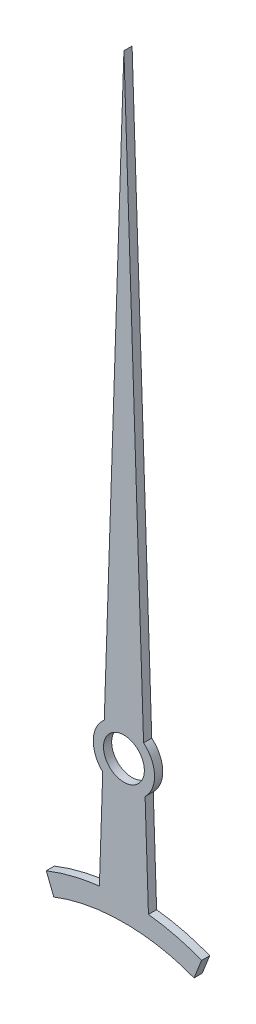
ISO-10303-21;
HEADER;
FILE_DESCRIPTION(('STEP AP214'),'2;1');
FILE_NAME('part.step','',(''),(''),'','','');
FILE_SCHEMA(('AUTOMOTIVE_DESIGN { 1 0 10303 214 1 1 1 1 }'));
ENDSEC;
DATA;
#1=APPLICATION_CONTEXT('core data for automotive mechanical design processes');
#2=APPLICATION_PROTOCOL_DEFINITION('international standard','automotive_design',2000,#1);
#3=PRODUCT_CONTEXT('',#1,'mechanical');
#4=PRODUCT('Part','Part','',(#3));
#5=PRODUCT_RELATED_PRODUCT_CATEGORY('part','',(#4));
#6=PRODUCT_DEFINITION_FORMATION('','',#4);
#7=PRODUCT_DEFINITION_CONTEXT('part definition',#1,'design');
#8=PRODUCT_DEFINITION('design','',#6,#7);
#9=PRODUCT_DEFINITION_SHAPE('','',#8);
#10=(LENGTH_UNIT() NAMED_UNIT(*) SI_UNIT(.MILLI.,.METRE.));
#11=(NAMED_UNIT(*) PLANE_ANGLE_UNIT() SI_UNIT($,.RADIAN.));
#12=(NAMED_UNIT(*) SI_UNIT($,.STERADIAN.) SOLID_ANGLE_UNIT());
#13=UNCERTAINTY_MEASURE_WITH_UNIT(LENGTH_MEASURE(1.E-05),#10,'distance_accuracy_value','');
#14=(GEOMETRIC_REPRESENTATION_CONTEXT(3) GLOBAL_UNCERTAINTY_ASSIGNED_CONTEXT((#13)) GLOBAL_UNIT_ASSIGNED_CONTEXT((#10,
#11,#12)) REPRESENTATION_CONTEXT('',''));
#15=CARTESIAN_POINT('',(0.,0.,0.));
#16=DIRECTION('',(0.,0.,1.));
#17=DIRECTION('',(1.,0.,0.));
#18=AXIS2_PLACEMENT_3D('',#15,#16,#17);
#19=CARTESIAN_POINT('',(-0.499445061043285,0.0166481687014428,0.2));
#20=DIRECTION('',(-0.999444906979154,0.0333148302326385,0.));
#21=DIRECTION('',(-0.0333148302326385,-0.999444906979154,0.));
#22=AXIS2_PLACEMENT_3D('',#19,#20,#21);
#23=PLANE('',#22);
#24=DIRECTION('',(0.0333148302326385,0.999444906979154,0.));
#25=VECTOR('',#24,1.);
#26=CARTESIAN_POINT('',(-0.499445061043285,0.0166481687014428,0.));
#27=LINE('',#26,#25);
#28=CARTESIAN_POINT('',(-0.480813238663485,0.575602840095434,0.));
#29=VERTEX_POINT('',#28);
#30=CARTESIAN_POINT('',(0.,15.,0.));
#31=VERTEX_POINT('',#30);
#32=EDGE_CURVE('E154',#29,#31,#27,.T.);
#33=ORIENTED_EDGE('',*,*,#32,.F.);
#34=DIRECTION('',(0.,0.,-1.));
#35=VECTOR('',#34,1.);
#36=CARTESIAN_POINT('',(-0.480813238663485,0.575602840095434,0.2));
#37=LINE('',#36,#35);
#38=CARTESIAN_POINT('',(-0.480813238663485,0.575602840095434,0.2));
#39=VERTEX_POINT('',#38);
#40=EDGE_CURVE('E11',#39,#29,#37,.T.);
#41=ORIENTED_EDGE('',*,*,#40,.F.);
#42=DIRECTION('',(0.0333148302326385,0.999444906979154,0.));
#43=VECTOR('',#42,1.);
#44=CARTESIAN_POINT('',(-0.499445061043285,0.0166481687014428,0.2));
#45=LINE('',#44,#43);
#46=CARTESIAN_POINT('',(0.,15.,0.2));
#47=VERTEX_POINT('',#46);
#48=EDGE_CURVE('E190',#39,#47,#45,.T.);
#49=ORIENTED_EDGE('',*,*,#48,.T.);
#50=DIRECTION('',(0.,0.,-1.));
#51=VECTOR('',#50,1.);
#52=CARTESIAN_POINT('',(0.,15.,0.2));
#53=LINE('',#52,#51);
#54=EDGE_CURVE('E50',#47,#31,#53,.T.);
#55=ORIENTED_EDGE('',*,*,#54,.T.);
#56=EDGE_LOOP('',(#33,#41,#49,#55));
#57=FACE_BOUND('',#56,.T.);
#58=ADVANCED_FACE('F34',(#57),#23,.T.);
#59=CARTESIAN_POINT('',(0.,0.,0.2));
#60=DIRECTION('',(0.,0.,-1.));
#61=DIRECTION('',(-1.,0.,0.));
#62=AXIS2_PLACEMENT_3D('',#59,#60,#61);
#63=CYLINDRICAL_SURFACE('',#62,0.75);
#64=CARTESIAN_POINT('',(0.,0.,0.));
#65=DIRECTION('',(0.,0.,1.));
#66=DIRECTION('',(1.,0.,0.));
#67=AXIS2_PLACEMENT_3D('',#64,#65,#66);
#68=CIRCLE('',#67,0.75);
#69=CARTESIAN_POINT('',(-0.518076883423085,-0.542306502692549,0.));
#70=VERTEX_POINT('',#69);
#71=EDGE_CURVE('E156',#29,#70,#68,.T.);
#72=ORIENTED_EDGE('',*,*,#71,.T.);
#73=DIRECTION('',(0.,0.,-1.));
#74=VECTOR('',#73,1.);
#75=CARTESIAN_POINT('',(-0.518076883423085,-0.542306502692549,0.2));
#76=LINE('',#75,#74);
#77=CARTESIAN_POINT('',(-0.518076883423085,-0.542306502692549,0.2));
#78=VERTEX_POINT('',#77);
#79=EDGE_CURVE('E42',#78,#70,#76,.T.);
#80=ORIENTED_EDGE('',*,*,#79,.F.);
#81=CARTESIAN_POINT('',(0.,0.,0.2));
#82=DIRECTION('',(0.,0.,1.));
#83=DIRECTION('',(1.,0.,0.));
#84=AXIS2_PLACEMENT_3D('',#81,#82,#83);
#85=CIRCLE('',#84,0.75);
#86=EDGE_CURVE('E136',#39,#78,#85,.T.);
#87=ORIENTED_EDGE('',*,*,#86,.F.);
#88=ORIENTED_EDGE('',*,*,#40,.T.);
#89=EDGE_LOOP('',(#72,#80,#87,#88));
#90=FACE_BOUND('',#89,.T.);
#91=ADVANCED_FACE('F275',(#90),#63,.T.);
#92=CARTESIAN_POINT('',(-0.499445061043285,0.0166481687014427,0.2));
#93=DIRECTION('',(0.999444906979154,-0.0333148302326382,0.));
#94=DIRECTION('',(0.0333148302326382,0.999444906979154,0.));
#95=AXIS2_PLACEMENT_3D('',#92,#93,#94);
#96=PLANE('',#95);
#97=DIRECTION('',(-0.0333148302326382,-0.999444906979154,0.));
#98=VECTOR('',#97,1.);
#99=CARTESIAN_POINT('',(-0.499445061043285,0.0166481687014427,0.));
#100=LINE('',#99,#98);
#101=CARTESIAN_POINT('',(-0.599999999999999,-3.,0.));
#102=VERTEX_POINT('',#101);
#103=EDGE_CURVE('E158',#70,#102,#100,.T.);
#104=ORIENTED_EDGE('',*,*,#103,.T.);
#105=DIRECTION('',(0.,0.,-1.));
#106=VECTOR('',#105,1.);
#107=CARTESIAN_POINT('',(-0.599999999999999,-3.,0.2));
#108=LINE('',#107,#106);
#109=CARTESIAN_POINT('',(-0.599999999999999,-3.,0.2));
#110=VERTEX_POINT('',#109);
#111=EDGE_CURVE('E204',#110,#102,#108,.T.);
#112=ORIENTED_EDGE('',*,*,#111,.F.);
#113=DIRECTION('',(-0.0333148302326382,-0.999444906979154,0.));
#114=VECTOR('',#113,1.);
#115=CARTESIAN_POINT('',(-0.499445061043285,0.0166481687014427,0.2));
#116=LINE('',#115,#114);
#117=EDGE_CURVE('E212',#78,#110,#116,.T.);
#118=ORIENTED_EDGE('',*,*,#117,.F.);
#119=ORIENTED_EDGE('',*,*,#79,.T.);
#120=EDGE_LOOP('',(#104,#112,#118,#119));
#121=FACE_BOUND('',#120,.T.);
#122=ADVANCED_FACE('F210',(#121),#96,.F.);
#123=CARTESIAN_POINT('',(-1.9,-3.32498143713202,0.2));
#124=CARTESIAN_POINT('',(-1.48291239155075,-3.15950522754239,0.2));
#125=CARTESIAN_POINT('',(-0.652310010937064,-2.9541690470115,0.2));
#126=CARTESIAN_POINT('',(0.652310010937064,-2.9541690470115,0.2));
#127=CARTESIAN_POINT('',(1.48291239155075,-3.15950522754239,0.2));
#128=CARTESIAN_POINT('',(1.9,-3.32498143713202,0.2));
#129=B_SPLINE_CURVE_WITH_KNOTS('',3,(#123,#124,#125,#126,#127,#128),.UNSPECIFIED.,.F.,.F.,(4,1,
1,4),(0.,0.3453612094493,0.6546387905507,1.),.UNSPECIFIED.);
#130=DIRECTION('',(0.,0.,-1.));
#131=VECTOR('',#130,1.);
#132=SURFACE_OF_LINEAR_EXTRUSION('',#129,#131);
#133=CARTESIAN_POINT('',(-1.9,-3.32498143713202,0.));
#134=CARTESIAN_POINT('',(-1.48291239155075,-3.15950522754239,0.));
#135=CARTESIAN_POINT('',(-0.652310010937064,-2.9541690470115,0.));
#136=CARTESIAN_POINT('',(0.652310010937064,-2.9541690470115,0.));
#137=CARTESIAN_POINT('',(1.48291239155075,-3.15950522754239,0.));
#138=CARTESIAN_POINT('',(1.9,-3.32498143713202,0.));
#139=B_SPLINE_CURVE_WITH_KNOTS('',3,(#133,#134,#135,#136,#137,#138),.UNSPECIFIED.,.F.,.F.,(4,1,
1,4),(0.,0.3453612094493,0.6546387905507,1.),.UNSPECIFIED.);
#140=CARTESIAN_POINT('',(-1.9,-3.32498143713202,0.));
#141=VERTEX_POINT('',#140);
#142=EDGE_CURVE('E162',#141,#102,#139,.T.);
#143=ORIENTED_EDGE('',*,*,#142,.F.);
#144=DIRECTION('',(0.,0.,-1.));
#145=VECTOR('',#144,1.);
#146=CARTESIAN_POINT('',(-1.9,-3.32498143713202,0.2));
#147=LINE('',#146,#145);
#148=CARTESIAN_POINT('',(-1.9,-3.32498143713202,0.2));
#149=VERTEX_POINT('',#148);
#150=EDGE_CURVE('E202',#149,#141,#147,.T.);
#151=ORIENTED_EDGE('',*,*,#150,.F.);
#152=EDGE_CURVE('E146',#149,#110,#129,.T.);
#153=ORIENTED_EDGE('',*,*,#152,.T.);
#154=ORIENTED_EDGE('',*,*,#111,.T.);
#155=EDGE_LOOP('',(#143,#151,#153,#154));
#156=FACE_BOUND('',#155,.T.);
#157=ADVANCED_FACE('F222',(#156),#132,.T.);
#158=CARTESIAN_POINT('',(-2.78136181440616,-1.10348329996309,0.2));
#159=DIRECTION('',(0.929517256428634,0.36877861923027,0.));
#160=DIRECTION('',(-0.36877861923027,0.929517256428634,0.));
#161=AXIS2_PLACEMENT_3D('',#158,#159,#160);
#162=PLANE('',#161);
#163=DIRECTION('',(0.36877861923027,-0.929517256428634,0.));
#164=VECTOR('',#163,1.);
#165=CARTESIAN_POINT('',(-2.78136181440616,-1.10348329996309,0.));
#166=LINE('',#165,#164);
#167=CARTESIAN_POINT('',(-1.71561069038486,-3.78974006534634,0.));
#168=VERTEX_POINT('',#167);
#169=EDGE_CURVE('E167',#141,#168,#166,.T.);
#170=ORIENTED_EDGE('',*,*,#169,.T.);
#171=DIRECTION('',(0.,0.,-1.));
#172=VECTOR('',#171,1.);
#173=CARTESIAN_POINT('',(-1.71561069038486,-3.78974006534634,0.2));
#174=LINE('',#173,#172);
#175=CARTESIAN_POINT('',(-1.71561069038486,-3.78974006534634,0.2));
#176=VERTEX_POINT('',#175);
#177=EDGE_CURVE('E199',#176,#168,#174,.T.);
#178=ORIENTED_EDGE('',*,*,#177,.F.);
#179=DIRECTION('',(0.36877861923027,-0.929517256428634,0.));
#180=VECTOR('',#179,1.);
#181=CARTESIAN_POINT('',(-2.78136181440616,-1.10348329996309,0.2));
#182=LINE('',#181,#180);
#183=EDGE_CURVE('E226',#149,#176,#182,.T.);
#184=ORIENTED_EDGE('',*,*,#183,.F.);
#185=ORIENTED_EDGE('',*,*,#150,.T.);
#186=EDGE_LOOP('',(#170,#178,#184,#185));
#187=FACE_BOUND('',#186,.T.);
#188=ADVANCED_FACE('F250',(#187),#162,.F.);
#189=CARTESIAN_POINT('',(-1.71561069038487,-3.78974006534634,0.2));
#190=CARTESIAN_POINT('',(-0.652484195700749,-3.36795303765513,0.2));
#191=CARTESIAN_POINT('',(0.652484195700749,-3.36795303765512,0.2));
#192=CARTESIAN_POINT('',(1.71561069038486,-3.78974006534634,0.2));
#193=B_SPLINE_CURVE_WITH_KNOTS('',3,(#189,#190,#191,#192),.UNSPECIFIED.,.F.,.F.,(4,4),(0.,1.),.UNSPECIFIED.);
#194=DIRECTION('',(0.,0.,-1.));
#195=VECTOR('',#194,1.);
#196=SURFACE_OF_LINEAR_EXTRUSION('',#193,#195);
#197=CARTESIAN_POINT('',(-1.71561069038487,-3.78974006534634,0.));
#198=CARTESIAN_POINT('',(-0.652484195700749,-3.36795303765513,0.));
#199=CARTESIAN_POINT('',(0.652484195700749,-3.36795303765512,0.));
#200=CARTESIAN_POINT('',(1.71561069038486,-3.78974006534634,0.));
#201=B_SPLINE_CURVE_WITH_KNOTS('',3,(#197,#198,#199,#200),.UNSPECIFIED.,.F.,.F.,(4,4),(0.,1.),.UNSPECIFIED.);
#202=CARTESIAN_POINT('',(1.71561069038486,-3.78974006534634,0.));
#203=VERTEX_POINT('',#202);
#204=EDGE_CURVE('E173',#168,#203,#201,.T.);
#205=ORIENTED_EDGE('',*,*,#204,.T.);
#206=DIRECTION('',(0.,0.,-1.));
#207=VECTOR('',#206,1.);
#208=CARTESIAN_POINT('',(1.71561069038486,-3.78974006534634,0.2));
#209=LINE('',#208,#207);
#210=CARTESIAN_POINT('',(1.71561069038486,-3.78974006534634,0.2));
#211=VERTEX_POINT('',#210);
#212=EDGE_CURVE('E196',#211,#203,#209,.T.);
#213=ORIENTED_EDGE('',*,*,#212,.F.);
#214=EDGE_CURVE('E227',#176,#211,#193,.T.);
#215=ORIENTED_EDGE('',*,*,#214,.F.);
#216=ORIENTED_EDGE('',*,*,#177,.T.);
#217=EDGE_LOOP('',(#205,#213,#215,#216));
#218=FACE_BOUND('',#217,.T.);
#219=ADVANCED_FACE('F246',(#218),#196,.F.);
#220=CARTESIAN_POINT('',(2.78136181440617,-1.1034832999631,0.2));
#221=DIRECTION('',(-0.929517256428633,0.368778619230273,0.));
#222=DIRECTION('',(-0.368778619230273,-0.929517256428633,0.));
#223=AXIS2_PLACEMENT_3D('',#220,#221,#222);
#224=PLANE('',#223);
#225=DIRECTION('',(0.368778619230273,0.929517256428633,0.));
#226=VECTOR('',#225,1.);
#227=CARTESIAN_POINT('',(2.78136181440617,-1.1034832999631,0.));
#228=LINE('',#227,#226);
#229=CARTESIAN_POINT('',(1.9,-3.32498143713202,0.));
#230=VERTEX_POINT('',#229);
#231=EDGE_CURVE('E177',#203,#230,#228,.T.);
#232=ORIENTED_EDGE('',*,*,#231,.T.);
#233=DIRECTION('',(0.,0.,-1.));
#234=VECTOR('',#233,1.);
#235=CARTESIAN_POINT('',(1.9,-3.32498143713202,0.2));
#236=LINE('',#235,#234);
#237=CARTESIAN_POINT('',(1.9,-3.32498143713202,0.2));
#238=VERTEX_POINT('',#237);
#239=EDGE_CURVE('E194',#238,#230,#236,.T.);
#240=ORIENTED_EDGE('',*,*,#239,.F.);
#241=DIRECTION('',(0.368778619230273,0.929517256428633,0.));
#242=VECTOR('',#241,1.);
#243=CARTESIAN_POINT('',(2.78136181440617,-1.1034832999631,0.2));
#244=LINE('',#243,#242);
#245=EDGE_CURVE('E144',#211,#238,#244,.T.);
#246=ORIENTED_EDGE('',*,*,#245,.F.);
#247=ORIENTED_EDGE('',*,*,#212,.T.);
#248=EDGE_LOOP('',(#232,#240,#246,#247));
#249=FACE_BOUND('',#248,.T.);
#250=ADVANCED_FACE('F241',(#249),#224,.F.);
#251=CARTESIAN_POINT('',(0.6,-3.,0.));
#252=VERTEX_POINT('',#251);
#253=EDGE_CURVE('E168',#252,#230,#139,.T.);
#254=ORIENTED_EDGE('',*,*,#253,.F.);
#255=DIRECTION('',(0.,0.,-1.));
#256=VECTOR('',#255,1.);
#257=CARTESIAN_POINT('',(0.6,-3.,0.2));
#258=LINE('',#257,#256);
#259=CARTESIAN_POINT('',(0.6,-3.,0.2));
#260=VERTEX_POINT('',#259);
#261=EDGE_CURVE('E128',#260,#252,#258,.T.);
#262=ORIENTED_EDGE('',*,*,#261,.F.);
#263=EDGE_CURVE('E142',#260,#238,#129,.T.);
#264=ORIENTED_EDGE('',*,*,#263,.T.);
#265=ORIENTED_EDGE('',*,*,#239,.T.);
#266=EDGE_LOOP('',(#254,#262,#264,#265));
#267=FACE_BOUND('',#266,.T.);
#268=ADVANCED_FACE('F237',(#267),#132,.T.);
#269=CARTESIAN_POINT('',(0.499445061043285,0.0166481687014428,0.2));
#270=DIRECTION('',(0.999444906979154,0.0333148302326384,0.));
#271=DIRECTION('',(-0.0333148302326384,0.999444906979154,0.));
#272=AXIS2_PLACEMENT_3D('',#269,#270,#271);
#273=PLANE('',#272);
#274=DIRECTION('',(0.0333148302326384,-0.999444906979154,0.));
#275=VECTOR('',#274,1.);
#276=CARTESIAN_POINT('',(0.499445061043285,0.0166481687014428,0.));
#277=LINE('',#276,#275);
#278=CARTESIAN_POINT('',(0.518076883423085,-0.542306502692548,0.));
#279=VERTEX_POINT('',#278);
#280=EDGE_CURVE('E125',#279,#252,#277,.T.);
#281=ORIENTED_EDGE('',*,*,#280,.F.);
#282=DIRECTION('',(0.,0.,-1.));
#283=VECTOR('',#282,1.);
#284=CARTESIAN_POINT('',(0.518076883423085,-0.542306502692548,0.2));
#285=LINE('',#284,#283);
#286=CARTESIAN_POINT('',(0.518076883423085,-0.542306502692548,0.2));
#287=VERTEX_POINT('',#286);
#288=EDGE_CURVE('E119',#287,#279,#285,.T.);
#289=ORIENTED_EDGE('',*,*,#288,.F.);
#290=DIRECTION('',(0.0333148302326384,-0.999444906979154,0.));
#291=VECTOR('',#290,1.);
#292=CARTESIAN_POINT('',(0.499445061043285,0.0166481687014428,0.2));
#293=LINE('',#292,#291);
#294=EDGE_CURVE('E123',#287,#260,#293,.T.);
#295=ORIENTED_EDGE('',*,*,#294,.T.);
#296=ORIENTED_EDGE('',*,*,#261,.T.);
#297=EDGE_LOOP('',(#281,#289,#295,#296));
#298=FACE_BOUND('',#297,.T.);
#299=ADVANCED_FACE('F121',(#298),#273,.T.);
#300=CARTESIAN_POINT('',(0.480813238663486,0.575602840095434,0.));
#301=VERTEX_POINT('',#300);
#302=EDGE_CURVE('E159',#279,#301,#68,.T.);
#303=ORIENTED_EDGE('',*,*,#302,.T.);
#304=DIRECTION('',(0.,0.,-1.));
#305=VECTOR('',#304,1.);
#306=CARTESIAN_POINT('',(0.480813238663486,0.575602840095434,0.2));
#307=LINE('',#306,#305);
#308=CARTESIAN_POINT('',(0.480813238663486,0.575602840095434,0.2));
#309=VERTEX_POINT('',#308);
#310=EDGE_CURVE('E85',#309,#301,#307,.T.);
#311=ORIENTED_EDGE('',*,*,#310,.F.);
#312=EDGE_CURVE('E130',#287,#309,#85,.T.);
#313=ORIENTED_EDGE('',*,*,#312,.F.);
#314=ORIENTED_EDGE('',*,*,#288,.T.);
#315=EDGE_LOOP('',(#303,#311,#313,#314));
#316=FACE_BOUND('',#315,.T.);
#317=ADVANCED_FACE('F131',(#316),#63,.T.);
#318=CARTESIAN_POINT('',(0.499445061043285,0.0166481687014428,0.2));
#319=DIRECTION('',(0.999444906979154,0.0333148302326385,0.));
#320=DIRECTION('',(-0.0333148302326385,0.999444906979154,0.));
#321=AXIS2_PLACEMENT_3D('',#318,#319,#320);
#322=PLANE('',#321);
#323=DIRECTION('',(0.0333148302326385,-0.999444906979154,0.));
#324=VECTOR('',#323,1.);
#325=CARTESIAN_POINT('',(0.499445061043285,0.0166481687014428,0.));
#326=LINE('',#325,#324);
#327=EDGE_CURVE('E184',#31,#301,#326,.T.);
#328=ORIENTED_EDGE('',*,*,#327,.F.);
#329=ORIENTED_EDGE('',*,*,#54,.F.);
#330=DIRECTION('',(0.0333148302326385,-0.999444906979154,0.));
#331=VECTOR('',#330,1.);
#332=CARTESIAN_POINT('',(0.499445061043285,0.0166481687014428,0.2));
#333=LINE('',#332,#331);
#334=EDGE_CURVE('E134',#47,#309,#333,.T.);
#335=ORIENTED_EDGE('',*,*,#334,.T.);
#336=ORIENTED_EDGE('',*,*,#310,.T.);
#337=EDGE_LOOP('',(#328,#329,#335,#336));
#338=FACE_BOUND('',#337,.T.);
#339=ADVANCED_FACE('F265',(#338),#322,.T.);
#340=CARTESIAN_POINT('',(0.,0.,0.2));
#341=DIRECTION('',(0.,0.,-1.));
#342=DIRECTION('',(-1.,0.,0.));
#343=AXIS2_PLACEMENT_3D('',#340,#341,#342);
#344=CYLINDRICAL_SURFACE('',#343,0.5);
#345=CARTESIAN_POINT('',(0.,0.,0.2));
#346=DIRECTION('',(0.,0.,1.));
#347=DIRECTION('',(1.,0.,0.));
#348=AXIS2_PLACEMENT_3D('',#345,#346,#347);
#349=CIRCLE('',#348,0.5);
#350=CARTESIAN_POINT('',(0.5,0.,0.2));
#351=VERTEX_POINT('',#350);
#352=EDGE_CURVE('E151',#351,#351,#349,.T.);
#353=ORIENTED_EDGE('',*,*,#352,.T.);
#354=EDGE_LOOP('',(#353));
#355=FACE_BOUND('',#354,.T.);
#356=CARTESIAN_POINT('',(0.,0.,0.));
#357=DIRECTION('',(0.,0.,1.));
#358=DIRECTION('',(1.,0.,0.));
#359=AXIS2_PLACEMENT_3D('',#356,#357,#358);
#360=CIRCLE('',#359,0.5);
#361=CARTESIAN_POINT('',(0.5,0.,0.));
#362=VERTEX_POINT('',#361);
#363=EDGE_CURVE('E187',#362,#362,#360,.T.);
#364=ORIENTED_EDGE('',*,*,#363,.F.);
#365=EDGE_LOOP('',(#364));
#366=FACE_BOUND('',#365,.T.);
#367=ADVANCED_FACE('F267',(#355,#366),#344,.F.);
#368=CARTESIAN_POINT('',(0.,0.,0.2));
#369=DIRECTION('',(0.,0.,1.));
#370=DIRECTION('',(1.,0.,0.));
#371=AXIS2_PLACEMENT_3D('',#368,#369,#370);
#372=PLANE('',#371);
#373=ORIENTED_EDGE('',*,*,#48,.F.);
#374=ORIENTED_EDGE('',*,*,#86,.T.);
#375=ORIENTED_EDGE('',*,*,#117,.T.);
#376=ORIENTED_EDGE('',*,*,#152,.F.);
#377=ORIENTED_EDGE('',*,*,#183,.T.);
#378=ORIENTED_EDGE('',*,*,#214,.T.);
#379=ORIENTED_EDGE('',*,*,#245,.T.);
#380=ORIENTED_EDGE('',*,*,#263,.F.);
#381=ORIENTED_EDGE('',*,*,#294,.F.);
#382=ORIENTED_EDGE('',*,*,#312,.T.);
#383=ORIENTED_EDGE('',*,*,#334,.F.);
#384=EDGE_LOOP('',(#373,#374,#375,#376,#377,#378,#379,#380,#381,#382,#383));
#385=FACE_BOUND('',#384,.T.);
#386=ORIENTED_EDGE('',*,*,#352,.F.);
#387=EDGE_LOOP('',(#386));
#388=FACE_BOUND('',#387,.T.);
#389=ADVANCED_FACE('F139',(#385,#388),#372,.T.);
#390=CARTESIAN_POINT('',(0.,0.,0.));
#391=DIRECTION('',(0.,0.,1.));
#392=DIRECTION('',(1.,0.,0.));
#393=AXIS2_PLACEMENT_3D('',#390,#391,#392);
#394=PLANE('',#393);
#395=ORIENTED_EDGE('',*,*,#32,.T.);
#396=ORIENTED_EDGE('',*,*,#327,.T.);
#397=ORIENTED_EDGE('',*,*,#302,.F.);
#398=ORIENTED_EDGE('',*,*,#280,.T.);
#399=ORIENTED_EDGE('',*,*,#253,.T.);
#400=ORIENTED_EDGE('',*,*,#231,.F.);
#401=ORIENTED_EDGE('',*,*,#204,.F.);
#402=ORIENTED_EDGE('',*,*,#169,.F.);
#403=ORIENTED_EDGE('',*,*,#142,.T.);
#404=ORIENTED_EDGE('',*,*,#103,.F.);
#405=ORIENTED_EDGE('',*,*,#71,.F.);
#406=EDGE_LOOP('',(#395,#396,#397,#398,#399,#400,#401,#402,#403,#404,#405));
#407=FACE_BOUND('',#406,.T.);
#408=ORIENTED_EDGE('',*,*,#363,.T.);
#409=EDGE_LOOP('',(#408));
#410=FACE_BOUND('',#409,.T.);
#411=ADVANCED_FACE('F216',(#407,#410),#394,.F.);
#412=CLOSED_SHELL('',(#58,#91,#122,#157,#188,#219,#250,#268,#299,#317,#339,#367,#389,#411));
#413=MANIFOLD_SOLID_BREP('B2',#412);
#414=ADVANCED_BREP_SHAPE_REPRESENTATION('',(#18,#413),#14);
#415=SHAPE_DEFINITION_REPRESENTATION(#9,#414);
ENDSEC;
END-ISO-10303-21;
